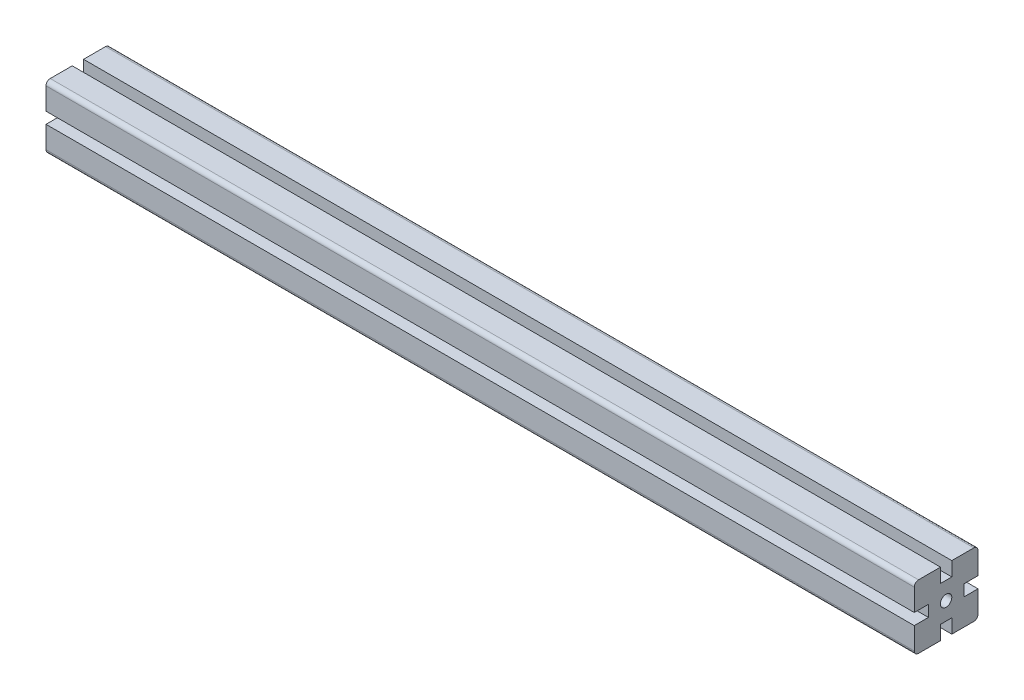
ISO-10303-21;
HEADER;
FILE_DESCRIPTION(('STEP AP214'),'2;1');
FILE_NAME('part.step','',(''),(''),'','','');
FILE_SCHEMA(('AUTOMOTIVE_DESIGN { 1 0 10303 214 1 1 1 1 }'));
ENDSEC;
DATA;
#1=APPLICATION_CONTEXT('core data for automotive mechanical design processes');
#2=APPLICATION_PROTOCOL_DEFINITION('international standard','automotive_design',2000,#1);
#3=PRODUCT_CONTEXT('',#1,'mechanical');
#4=PRODUCT('Part','Part','',(#3));
#5=PRODUCT_RELATED_PRODUCT_CATEGORY('part','',(#4));
#6=PRODUCT_DEFINITION_FORMATION('','',#4);
#7=PRODUCT_DEFINITION_CONTEXT('part definition',#1,'design');
#8=PRODUCT_DEFINITION('design','',#6,#7);
#9=PRODUCT_DEFINITION_SHAPE('','',#8);
#10=(LENGTH_UNIT() NAMED_UNIT(*) SI_UNIT(.MILLI.,.METRE.));
#11=(NAMED_UNIT(*) PLANE_ANGLE_UNIT() SI_UNIT($,.RADIAN.));
#12=(NAMED_UNIT(*) SI_UNIT($,.STERADIAN.) SOLID_ANGLE_UNIT());
#13=UNCERTAINTY_MEASURE_WITH_UNIT(LENGTH_MEASURE(1.E-05),#10,'distance_accuracy_value','');
#14=(GEOMETRIC_REPRESENTATION_CONTEXT(3) GLOBAL_UNCERTAINTY_ASSIGNED_CONTEXT((#13)) GLOBAL_UNIT_ASSIGNED_CONTEXT((#10,
#11,#12)) REPRESENTATION_CONTEXT('',''));
#15=CARTESIAN_POINT('',(0.,0.,0.));
#16=DIRECTION('',(0.,0.,1.));
#17=DIRECTION('',(1.,0.,0.));
#18=AXIS2_PLACEMENT_3D('',#15,#16,#17);
#19=CARTESIAN_POINT('',(387.,-22.5,-22.5));
#20=DIRECTION('',(0.,0.,-1.));
#21=DIRECTION('',(0.,1.,0.));
#22=AXIS2_PLACEMENT_3D('',#19,#20,#21);
#23=PLANE('',#22);
#24=DIRECTION('',(0.,1.,0.));
#25=VECTOR('',#24,1.);
#26=CARTESIAN_POINT('',(1000.,-22.5,-22.5));
#27=LINE('',#26,#25);
#28=CARTESIAN_POINT('',(1000.,-19.5,-22.5));
#29=VERTEX_POINT('',#28);
#30=CARTESIAN_POINT('',(1000.,-4.,-22.5));
#31=VERTEX_POINT('',#30);
#32=EDGE_CURVE('E268',#29,#31,#27,.T.);
#33=ORIENTED_EDGE('',*,*,#32,.F.);
#34=DIRECTION('',(1.,0.,0.));
#35=VECTOR('',#34,1.);
#36=CARTESIAN_POINT('',(387.,-19.5,-22.5));
#37=LINE('',#36,#35);
#38=CARTESIAN_POINT('',(387.,-19.5,-22.5));
#39=VERTEX_POINT('',#38);
#40=EDGE_CURVE('E199',#29,#39,#37,.F.);
#41=ORIENTED_EDGE('',*,*,#40,.T.);
#42=DIRECTION('',(0.,1.,0.));
#43=VECTOR('',#42,1.);
#44=CARTESIAN_POINT('',(387.,-22.5,-22.5));
#45=LINE('',#44,#43);
#46=CARTESIAN_POINT('',(387.,-4.,-22.5));
#47=VERTEX_POINT('',#46);
#48=EDGE_CURVE('E193',#39,#47,#45,.T.);
#49=ORIENTED_EDGE('',*,*,#48,.T.);
#50=DIRECTION('',(1.,0.,0.));
#51=VECTOR('',#50,1.);
#52=CARTESIAN_POINT('',(387.,-4.,-22.5));
#53=LINE('',#52,#51);
#54=EDGE_CURVE('E196',#47,#31,#53,.T.);
#55=ORIENTED_EDGE('',*,*,#54,.T.);
#56=EDGE_LOOP('',(#33,#41,#49,#55));
#57=FACE_BOUND('',#56,.T.);
#58=ADVANCED_FACE('F32',(#57),#23,.T.);
#59=CARTESIAN_POINT('',(387.,-22.5,-4.00000000000001));
#60=DIRECTION('',(0.,-1.,0.));
#61=DIRECTION('',(0.,0.,-1.));
#62=AXIS2_PLACEMENT_3D('',#59,#60,#61);
#63=PLANE('',#62);
#64=DIRECTION('',(0.,0.,-1.));
#65=VECTOR('',#64,1.);
#66=CARTESIAN_POINT('',(387.,-22.5,-4.00000000000001));
#67=LINE('',#66,#65);
#68=CARTESIAN_POINT('',(387.,-22.5,-4.00000000000001));
#69=VERTEX_POINT('',#68);
#70=CARTESIAN_POINT('',(387.,-22.5,-19.5));
#71=VERTEX_POINT('',#70);
#72=EDGE_CURVE('E211',#69,#71,#67,.T.);
#73=ORIENTED_EDGE('',*,*,#72,.T.);
#74=DIRECTION('',(1.,0.,0.));
#75=VECTOR('',#74,1.);
#76=CARTESIAN_POINT('',(387.,-22.5,-19.5));
#77=LINE('',#76,#75);
#78=CARTESIAN_POINT('',(1000.,-22.5,-19.5));
#79=VERTEX_POINT('',#78);
#80=EDGE_CURVE('E324',#71,#79,#77,.T.);
#81=ORIENTED_EDGE('',*,*,#80,.T.);
#82=DIRECTION('',(0.,0.,-1.));
#83=VECTOR('',#82,1.);
#84=CARTESIAN_POINT('',(1000.,-22.5,-4.00000000000001));
#85=LINE('',#84,#83);
#86=CARTESIAN_POINT('',(1000.,-22.5,-4.00000000000001));
#87=VERTEX_POINT('',#86);
#88=EDGE_CURVE('E203',#87,#79,#85,.T.);
#89=ORIENTED_EDGE('',*,*,#88,.F.);
#90=DIRECTION('',(1.,0.,0.));
#91=VECTOR('',#90,1.);
#92=CARTESIAN_POINT('',(387.,-22.5,-4.00000000000001));
#93=LINE('',#92,#91);
#94=EDGE_CURVE('E322',#69,#87,#93,.T.);
#95=ORIENTED_EDGE('',*,*,#94,.F.);
#96=EDGE_LOOP('',(#73,#81,#89,#95));
#97=FACE_BOUND('',#96,.T.);
#98=ADVANCED_FACE('F402',(#97),#63,.T.);
#99=CARTESIAN_POINT('',(387.,-12.5,-4.));
#100=DIRECTION('',(0.,0.,1.));
#101=DIRECTION('',(0.,-1.,0.));
#102=AXIS2_PLACEMENT_3D('',#99,#100,#101);
#103=PLANE('',#102);
#104=DIRECTION('',(0.,-1.,0.));
#105=VECTOR('',#104,1.);
#106=CARTESIAN_POINT('',(1000.,-12.5,-4.));
#107=LINE('',#106,#105);
#108=CARTESIAN_POINT('',(1000.,-12.5,-4.));
#109=VERTEX_POINT('',#108);
#110=EDGE_CURVE('E317',#109,#87,#107,.T.);
#111=ORIENTED_EDGE('',*,*,#110,.F.);
#112=DIRECTION('',(1.,0.,0.));
#113=VECTOR('',#112,1.);
#114=CARTESIAN_POINT('',(387.,-12.5,-4.));
#115=LINE('',#114,#113);
#116=CARTESIAN_POINT('',(387.,-12.5,-4.));
#117=VERTEX_POINT('',#116);
#118=EDGE_CURVE('E325',#117,#109,#115,.T.);
#119=ORIENTED_EDGE('',*,*,#118,.F.);
#120=DIRECTION('',(0.,-1.,0.));
#121=VECTOR('',#120,1.);
#122=CARTESIAN_POINT('',(387.,-12.5,-4.));
#123=LINE('',#122,#121);
#124=EDGE_CURVE('E263',#117,#69,#123,.T.);
#125=ORIENTED_EDGE('',*,*,#124,.T.);
#126=ORIENTED_EDGE('',*,*,#94,.T.);
#127=EDGE_LOOP('',(#111,#119,#125,#126));
#128=FACE_BOUND('',#127,.T.);
#129=ADVANCED_FACE('F406',(#128),#103,.T.);
#130=CARTESIAN_POINT('',(387.,-12.5,4.));
#131=DIRECTION('',(0.,-1.,0.));
#132=DIRECTION('',(0.,0.,-1.));
#133=AXIS2_PLACEMENT_3D('',#130,#131,#132);
#134=PLANE('',#133);
#135=DIRECTION('',(0.,0.,-1.));
#136=VECTOR('',#135,1.);
#137=CARTESIAN_POINT('',(1000.,-12.5,4.));
#138=LINE('',#137,#136);
#139=CARTESIAN_POINT('',(1000.,-12.5,4.));
#140=VERTEX_POINT('',#139);
#141=EDGE_CURVE('E314',#140,#109,#138,.T.);
#142=ORIENTED_EDGE('',*,*,#141,.F.);
#143=DIRECTION('',(1.,0.,0.));
#144=VECTOR('',#143,1.);
#145=CARTESIAN_POINT('',(387.,-12.5,4.));
#146=LINE('',#145,#144);
#147=CARTESIAN_POINT('',(387.,-12.5,4.));
#148=VERTEX_POINT('',#147);
#149=EDGE_CURVE('E327',#148,#140,#146,.T.);
#150=ORIENTED_EDGE('',*,*,#149,.F.);
#151=DIRECTION('',(0.,0.,-1.));
#152=VECTOR('',#151,1.);
#153=CARTESIAN_POINT('',(387.,-12.5,4.));
#154=LINE('',#153,#152);
#155=EDGE_CURVE('E260',#148,#117,#154,.T.);
#156=ORIENTED_EDGE('',*,*,#155,.T.);
#157=ORIENTED_EDGE('',*,*,#118,.T.);
#158=EDGE_LOOP('',(#142,#150,#156,#157));
#159=FACE_BOUND('',#158,.T.);
#160=ADVANCED_FACE('F411',(#159),#134,.T.);
#161=CARTESIAN_POINT('',(387.,-22.5,4.00000000000001));
#162=DIRECTION('',(0.,0.,-1.));
#163=DIRECTION('',(0.,1.,0.));
#164=AXIS2_PLACEMENT_3D('',#161,#162,#163);
#165=PLANE('',#164);
#166=DIRECTION('',(0.,1.,0.));
#167=VECTOR('',#166,1.);
#168=CARTESIAN_POINT('',(1000.,-22.5,4.00000000000001));
#169=LINE('',#168,#167);
#170=CARTESIAN_POINT('',(1000.,-22.5,4.00000000000001));
#171=VERTEX_POINT('',#170);
#172=EDGE_CURVE('E311',#171,#140,#169,.T.);
#173=ORIENTED_EDGE('',*,*,#172,.F.);
#174=DIRECTION('',(1.,0.,0.));
#175=VECTOR('',#174,1.);
#176=CARTESIAN_POINT('',(387.,-22.5,4.00000000000001));
#177=LINE('',#176,#175);
#178=CARTESIAN_POINT('',(387.,-22.5,4.00000000000001));
#179=VERTEX_POINT('',#178);
#180=EDGE_CURVE('E329',#179,#171,#177,.T.);
#181=ORIENTED_EDGE('',*,*,#180,.F.);
#182=DIRECTION('',(0.,1.,0.));
#183=VECTOR('',#182,1.);
#184=CARTESIAN_POINT('',(387.,-22.5,4.00000000000001));
#185=LINE('',#184,#183);
#186=EDGE_CURVE('E257',#179,#148,#185,.T.);
#187=ORIENTED_EDGE('',*,*,#186,.T.);
#188=ORIENTED_EDGE('',*,*,#149,.T.);
#189=EDGE_LOOP('',(#173,#181,#187,#188));
#190=FACE_BOUND('',#189,.T.);
#191=ADVANCED_FACE('F414',(#190),#165,.T.);
#192=CARTESIAN_POINT('',(387.,-22.5,22.5));
#193=DIRECTION('',(0.,-1.,0.));
#194=DIRECTION('',(0.,0.,-1.));
#195=AXIS2_PLACEMENT_3D('',#192,#193,#194);
#196=PLANE('',#195);
#197=DIRECTION('',(0.,0.,-1.));
#198=VECTOR('',#197,1.);
#199=CARTESIAN_POINT('',(1000.,-22.5,22.5));
#200=LINE('',#199,#198);
#201=CARTESIAN_POINT('',(1000.,-22.5,19.5));
#202=VERTEX_POINT('',#201);
#203=EDGE_CURVE('E309',#202,#171,#200,.T.);
#204=ORIENTED_EDGE('',*,*,#203,.F.);
#205=DIRECTION('',(1.,0.,0.));
#206=VECTOR('',#205,1.);
#207=CARTESIAN_POINT('',(387.,-22.5,19.5));
#208=LINE('',#207,#206);
#209=CARTESIAN_POINT('',(387.,-22.5,19.5));
#210=VERTEX_POINT('',#209);
#211=EDGE_CURVE('E376',#202,#210,#208,.F.);
#212=ORIENTED_EDGE('',*,*,#211,.T.);
#213=DIRECTION('',(0.,0.,-1.));
#214=VECTOR('',#213,1.);
#215=CARTESIAN_POINT('',(387.,-22.5,22.5));
#216=LINE('',#215,#214);
#217=EDGE_CURVE('E255',#210,#179,#216,.T.);
#218=ORIENTED_EDGE('',*,*,#217,.T.);
#219=ORIENTED_EDGE('',*,*,#180,.T.);
#220=EDGE_LOOP('',(#204,#212,#218,#219));
#221=FACE_BOUND('',#220,.T.);
#222=ADVANCED_FACE('F627',(#221),#196,.T.);
#223=CARTESIAN_POINT('',(387.,-4.,22.5));
#224=DIRECTION('',(0.,0.,1.));
#225=DIRECTION('',(0.,-1.,0.));
#226=AXIS2_PLACEMENT_3D('',#223,#224,#225);
#227=PLANE('',#226);
#228=DIRECTION('',(0.,-1.,0.));
#229=VECTOR('',#228,1.);
#230=CARTESIAN_POINT('',(387.,-4.,22.5));
#231=LINE('',#230,#229);
#232=CARTESIAN_POINT('',(387.,-4.,22.5));
#233=VERTEX_POINT('',#232);
#234=CARTESIAN_POINT('',(387.,-19.5,22.5));
#235=VERTEX_POINT('',#234);
#236=EDGE_CURVE('E252',#233,#235,#231,.T.);
#237=ORIENTED_EDGE('',*,*,#236,.T.);
#238=DIRECTION('',(1.,0.,0.));
#239=VECTOR('',#238,1.);
#240=CARTESIAN_POINT('',(387.,-19.5,22.5));
#241=LINE('',#240,#239);
#242=CARTESIAN_POINT('',(1000.,-19.5,22.5));
#243=VERTEX_POINT('',#242);
#244=EDGE_CURVE('E373',#235,#243,#241,.T.);
#245=ORIENTED_EDGE('',*,*,#244,.T.);
#246=DIRECTION('',(0.,-1.,0.));
#247=VECTOR('',#246,1.);
#248=CARTESIAN_POINT('',(1000.,-4.,22.5));
#249=LINE('',#248,#247);
#250=CARTESIAN_POINT('',(1000.,-4.,22.5));
#251=VERTEX_POINT('',#250);
#252=EDGE_CURVE('E306',#251,#243,#249,.T.);
#253=ORIENTED_EDGE('',*,*,#252,.F.);
#254=DIRECTION('',(1.,0.,0.));
#255=VECTOR('',#254,1.);
#256=CARTESIAN_POINT('',(387.,-4.,22.5));
#257=LINE('',#256,#255);
#258=EDGE_CURVE('E332',#233,#251,#257,.T.);
#259=ORIENTED_EDGE('',*,*,#258,.F.);
#260=EDGE_LOOP('',(#237,#245,#253,#259));
#261=FACE_BOUND('',#260,.T.);
#262=ADVANCED_FACE('F426',(#261),#227,.T.);
#263=CARTESIAN_POINT('',(387.,-4.,12.5));
#264=DIRECTION('',(0.,1.,0.));
#265=DIRECTION('',(0.,0.,1.));
#266=AXIS2_PLACEMENT_3D('',#263,#264,#265);
#267=PLANE('',#266);
#268=DIRECTION('',(0.,0.,1.));
#269=VECTOR('',#268,1.);
#270=CARTESIAN_POINT('',(1000.,-4.,12.5));
#271=LINE('',#270,#269);
#272=CARTESIAN_POINT('',(1000.,-4.,12.5));
#273=VERTEX_POINT('',#272);
#274=EDGE_CURVE('E303',#273,#251,#271,.T.);
#275=ORIENTED_EDGE('',*,*,#274,.F.);
#276=DIRECTION('',(1.,0.,0.));
#277=VECTOR('',#276,1.);
#278=CARTESIAN_POINT('',(387.,-4.,12.5));
#279=LINE('',#278,#277);
#280=CARTESIAN_POINT('',(387.,-4.,12.5));
#281=VERTEX_POINT('',#280);
#282=EDGE_CURVE('E334',#281,#273,#279,.T.);
#283=ORIENTED_EDGE('',*,*,#282,.F.);
#284=DIRECTION('',(0.,0.,1.));
#285=VECTOR('',#284,1.);
#286=CARTESIAN_POINT('',(387.,-4.,12.5));
#287=LINE('',#286,#285);
#288=EDGE_CURVE('E249',#281,#233,#287,.T.);
#289=ORIENTED_EDGE('',*,*,#288,.T.);
#290=ORIENTED_EDGE('',*,*,#258,.T.);
#291=EDGE_LOOP('',(#275,#283,#289,#290));
#292=FACE_BOUND('',#291,.T.);
#293=ADVANCED_FACE('F431',(#292),#267,.T.);
#294=CARTESIAN_POINT('',(387.,4.,12.5));
#295=DIRECTION('',(0.,0.,1.));
#296=DIRECTION('',(1.,0.,0.));
#297=AXIS2_PLACEMENT_3D('',#294,#295,#296);
#298=PLANE('',#297);
#299=DIRECTION('',(0.,-1.,0.));
#300=VECTOR('',#299,1.);
#301=CARTESIAN_POINT('',(1000.,4.,12.5));
#302=LINE('',#301,#300);
#303=CARTESIAN_POINT('',(1000.,4.,12.5));
#304=VERTEX_POINT('',#303);
#305=EDGE_CURVE('E300',#304,#273,#302,.T.);
#306=ORIENTED_EDGE('',*,*,#305,.F.);
#307=DIRECTION('',(1.,0.,0.));
#308=VECTOR('',#307,1.);
#309=CARTESIAN_POINT('',(387.,4.,12.5));
#310=LINE('',#309,#308);
#311=CARTESIAN_POINT('',(387.,4.,12.5));
#312=VERTEX_POINT('',#311);
#313=EDGE_CURVE('E336',#312,#304,#310,.T.);
#314=ORIENTED_EDGE('',*,*,#313,.F.);
#315=DIRECTION('',(0.,-1.,0.));
#316=VECTOR('',#315,1.);
#317=CARTESIAN_POINT('',(387.,4.,12.5));
#318=LINE('',#317,#316);
#319=EDGE_CURVE('E246',#312,#281,#318,.T.);
#320=ORIENTED_EDGE('',*,*,#319,.T.);
#321=ORIENTED_EDGE('',*,*,#282,.T.);
#322=EDGE_LOOP('',(#306,#314,#320,#321));
#323=FACE_BOUND('',#322,.T.);
#324=ADVANCED_FACE('F436',(#323),#298,.T.);
#325=CARTESIAN_POINT('',(387.,4.,22.5));
#326=DIRECTION('',(0.,-1.,0.));
#327=DIRECTION('',(0.,0.,-1.));
#328=AXIS2_PLACEMENT_3D('',#325,#326,#327);
#329=PLANE('',#328);
#330=DIRECTION('',(0.,0.,-1.));
#331=VECTOR('',#330,1.);
#332=CARTESIAN_POINT('',(1000.,4.,22.5));
#333=LINE('',#332,#331);
#334=CARTESIAN_POINT('',(1000.,4.,22.5));
#335=VERTEX_POINT('',#334);
#336=EDGE_CURVE('E297',#335,#304,#333,.T.);
#337=ORIENTED_EDGE('',*,*,#336,.F.);
#338=DIRECTION('',(1.,0.,0.));
#339=VECTOR('',#338,1.);
#340=CARTESIAN_POINT('',(387.,4.,22.5));
#341=LINE('',#340,#339);
#342=CARTESIAN_POINT('',(387.,4.,22.5));
#343=VERTEX_POINT('',#342);
#344=EDGE_CURVE('E338',#343,#335,#341,.T.);
#345=ORIENTED_EDGE('',*,*,#344,.F.);
#346=DIRECTION('',(0.,0.,-1.));
#347=VECTOR('',#346,1.);
#348=CARTESIAN_POINT('',(387.,4.,22.5));
#349=LINE('',#348,#347);
#350=EDGE_CURVE('E243',#343,#312,#349,.T.);
#351=ORIENTED_EDGE('',*,*,#350,.T.);
#352=ORIENTED_EDGE('',*,*,#313,.T.);
#353=EDGE_LOOP('',(#337,#345,#351,#352));
#354=FACE_BOUND('',#353,.T.);
#355=ADVANCED_FACE('F439',(#354),#329,.T.);
#356=CARTESIAN_POINT('',(387.,22.5,22.5));
#357=DIRECTION('',(0.,0.,1.));
#358=DIRECTION('',(0.,-1.,0.));
#359=AXIS2_PLACEMENT_3D('',#356,#357,#358);
#360=PLANE('',#359);
#361=DIRECTION('',(0.,-1.,0.));
#362=VECTOR('',#361,1.);
#363=CARTESIAN_POINT('',(1000.,22.5,22.5));
#364=LINE('',#363,#362);
#365=CARTESIAN_POINT('',(1000.,19.5,22.5));
#366=VERTEX_POINT('',#365);
#367=EDGE_CURVE('E295',#366,#335,#364,.T.);
#368=ORIENTED_EDGE('',*,*,#367,.F.);
#369=DIRECTION('',(1.,0.,0.));
#370=VECTOR('',#369,1.);
#371=CARTESIAN_POINT('',(387.,19.5,22.5));
#372=LINE('',#371,#370);
#373=CARTESIAN_POINT('',(387.,19.5,22.5));
#374=VERTEX_POINT('',#373);
#375=EDGE_CURVE('E381',#366,#374,#372,.F.);
#376=ORIENTED_EDGE('',*,*,#375,.T.);
#377=DIRECTION('',(0.,-1.,0.));
#378=VECTOR('',#377,1.);
#379=CARTESIAN_POINT('',(387.,22.5,22.5));
#380=LINE('',#379,#378);
#381=EDGE_CURVE('E241',#374,#343,#380,.T.);
#382=ORIENTED_EDGE('',*,*,#381,.T.);
#383=ORIENTED_EDGE('',*,*,#344,.T.);
#384=EDGE_LOOP('',(#368,#376,#382,#383));
#385=FACE_BOUND('',#384,.T.);
#386=ADVANCED_FACE('F591',(#385),#360,.T.);
#387=CARTESIAN_POINT('',(387.,22.5,4.));
#388=DIRECTION('',(0.,1.,0.));
#389=DIRECTION('',(0.,0.,1.));
#390=AXIS2_PLACEMENT_3D('',#387,#388,#389);
#391=PLANE('',#390);
#392=DIRECTION('',(0.,0.,1.));
#393=VECTOR('',#392,1.);
#394=CARTESIAN_POINT('',(387.,22.5,4.));
#395=LINE('',#394,#393);
#396=CARTESIAN_POINT('',(387.,22.5,4.));
#397=VERTEX_POINT('',#396);
#398=CARTESIAN_POINT('',(387.,22.5,19.5));
#399=VERTEX_POINT('',#398);
#400=EDGE_CURVE('E238',#397,#399,#395,.T.);
#401=ORIENTED_EDGE('',*,*,#400,.T.);
#402=DIRECTION('',(1.,0.,0.));
#403=VECTOR('',#402,1.);
#404=CARTESIAN_POINT('',(387.,22.5,19.5));
#405=LINE('',#404,#403);
#406=CARTESIAN_POINT('',(1000.,22.5,19.5));
#407=VERTEX_POINT('',#406);
#408=EDGE_CURVE('E378',#399,#407,#405,.T.);
#409=ORIENTED_EDGE('',*,*,#408,.T.);
#410=DIRECTION('',(0.,0.,1.));
#411=VECTOR('',#410,1.);
#412=CARTESIAN_POINT('',(1000.,22.5,4.));
#413=LINE('',#412,#411);
#414=CARTESIAN_POINT('',(1000.,22.5,4.));
#415=VERTEX_POINT('',#414);
#416=EDGE_CURVE('E292',#415,#407,#413,.T.);
#417=ORIENTED_EDGE('',*,*,#416,.F.);
#418=DIRECTION('',(1.,0.,0.));
#419=VECTOR('',#418,1.);
#420=CARTESIAN_POINT('',(387.,22.5,4.));
#421=LINE('',#420,#419);
#422=EDGE_CURVE('E341',#397,#415,#421,.T.);
#423=ORIENTED_EDGE('',*,*,#422,.F.);
#424=EDGE_LOOP('',(#401,#409,#417,#423));
#425=FACE_BOUND('',#424,.T.);
#426=ADVANCED_FACE('F451',(#425),#391,.T.);
#427=CARTESIAN_POINT('',(387.,12.5,4.));
#428=DIRECTION('',(0.,0.,-1.));
#429=DIRECTION('',(0.,1.,0.));
#430=AXIS2_PLACEMENT_3D('',#427,#428,#429);
#431=PLANE('',#430);
#432=DIRECTION('',(0.,1.,0.));
#433=VECTOR('',#432,1.);
#434=CARTESIAN_POINT('',(1000.,12.5,4.));
#435=LINE('',#434,#433);
#436=CARTESIAN_POINT('',(1000.,12.5,4.));
#437=VERTEX_POINT('',#436);
#438=EDGE_CURVE('E289',#437,#415,#435,.T.);
#439=ORIENTED_EDGE('',*,*,#438,.F.);
#440=DIRECTION('',(1.,0.,0.));
#441=VECTOR('',#440,1.);
#442=CARTESIAN_POINT('',(387.,12.5,4.));
#443=LINE('',#442,#441);
#444=CARTESIAN_POINT('',(387.,12.5,4.));
#445=VERTEX_POINT('',#444);
#446=EDGE_CURVE('E343',#445,#437,#443,.T.);
#447=ORIENTED_EDGE('',*,*,#446,.F.);
#448=DIRECTION('',(0.,1.,0.));
#449=VECTOR('',#448,1.);
#450=CARTESIAN_POINT('',(387.,12.5,4.));
#451=LINE('',#450,#449);
#452=EDGE_CURVE('E235',#445,#397,#451,.T.);
#453=ORIENTED_EDGE('',*,*,#452,.T.);
#454=ORIENTED_EDGE('',*,*,#422,.T.);
#455=EDGE_LOOP('',(#439,#447,#453,#454));
#456=FACE_BOUND('',#455,.T.);
#457=ADVANCED_FACE('F456',(#456),#431,.T.);
#458=CARTESIAN_POINT('',(387.,12.5,-4.));
#459=DIRECTION('',(0.,1.,0.));
#460=DIRECTION('',(0.,0.,1.));
#461=AXIS2_PLACEMENT_3D('',#458,#459,#460);
#462=PLANE('',#461);
#463=DIRECTION('',(0.,0.,1.));
#464=VECTOR('',#463,1.);
#465=CARTESIAN_POINT('',(1000.,12.5,-4.));
#466=LINE('',#465,#464);
#467=CARTESIAN_POINT('',(1000.,12.5,-4.));
#468=VERTEX_POINT('',#467);
#469=EDGE_CURVE('E286',#468,#437,#466,.T.);
#470=ORIENTED_EDGE('',*,*,#469,.F.);
#471=DIRECTION('',(1.,0.,0.));
#472=VECTOR('',#471,1.);
#473=CARTESIAN_POINT('',(387.,12.5,-4.));
#474=LINE('',#473,#472);
#475=CARTESIAN_POINT('',(387.,12.5,-4.));
#476=VERTEX_POINT('',#475);
#477=EDGE_CURVE('E345',#476,#468,#474,.T.);
#478=ORIENTED_EDGE('',*,*,#477,.F.);
#479=DIRECTION('',(0.,0.,1.));
#480=VECTOR('',#479,1.);
#481=CARTESIAN_POINT('',(387.,12.5,-4.));
#482=LINE('',#481,#480);
#483=EDGE_CURVE('E232',#476,#445,#482,.T.);
#484=ORIENTED_EDGE('',*,*,#483,.T.);
#485=ORIENTED_EDGE('',*,*,#446,.T.);
#486=EDGE_LOOP('',(#470,#478,#484,#485));
#487=FACE_BOUND('',#486,.T.);
#488=ADVANCED_FACE('F461',(#487),#462,.T.);
#489=CARTESIAN_POINT('',(387.,22.5,-4.));
#490=DIRECTION('',(0.,0.,1.));
#491=DIRECTION('',(0.,-1.,0.));
#492=AXIS2_PLACEMENT_3D('',#489,#490,#491);
#493=PLANE('',#492);
#494=DIRECTION('',(0.,-1.,0.));
#495=VECTOR('',#494,1.);
#496=CARTESIAN_POINT('',(1000.,22.5,-4.));
#497=LINE('',#496,#495);
#498=CARTESIAN_POINT('',(1000.,22.5,-4.));
#499=VERTEX_POINT('',#498);
#500=EDGE_CURVE('E283',#499,#468,#497,.T.);
#501=ORIENTED_EDGE('',*,*,#500,.F.);
#502=DIRECTION('',(1.,0.,0.));
#503=VECTOR('',#502,1.);
#504=CARTESIAN_POINT('',(387.,22.5,-4.));
#505=LINE('',#504,#503);
#506=CARTESIAN_POINT('',(387.,22.5,-4.));
#507=VERTEX_POINT('',#506);
#508=EDGE_CURVE('E347',#507,#499,#505,.T.);
#509=ORIENTED_EDGE('',*,*,#508,.F.);
#510=DIRECTION('',(0.,-1.,0.));
#511=VECTOR('',#510,1.);
#512=CARTESIAN_POINT('',(387.,22.5,-4.));
#513=LINE('',#512,#511);
#514=EDGE_CURVE('E229',#507,#476,#513,.T.);
#515=ORIENTED_EDGE('',*,*,#514,.T.);
#516=ORIENTED_EDGE('',*,*,#477,.T.);
#517=EDGE_LOOP('',(#501,#509,#515,#516));
#518=FACE_BOUND('',#517,.T.);
#519=ADVANCED_FACE('F464',(#518),#493,.T.);
#520=CARTESIAN_POINT('',(387.,22.5,-22.5));
#521=DIRECTION('',(0.,1.,0.));
#522=DIRECTION('',(0.,0.,1.));
#523=AXIS2_PLACEMENT_3D('',#520,#521,#522);
#524=PLANE('',#523);
#525=DIRECTION('',(0.,0.,1.));
#526=VECTOR('',#525,1.);
#527=CARTESIAN_POINT('',(1000.,22.5,-22.5));
#528=LINE('',#527,#526);
#529=CARTESIAN_POINT('',(1000.,22.5,-19.5));
#530=VERTEX_POINT('',#529);
#531=EDGE_CURVE('E281',#530,#499,#528,.T.);
#532=ORIENTED_EDGE('',*,*,#531,.F.);
#533=DIRECTION('',(1.,0.,0.));
#534=VECTOR('',#533,1.);
#535=CARTESIAN_POINT('',(387.,22.5,-19.5));
#536=LINE('',#535,#534);
#537=CARTESIAN_POINT('',(387.,22.5,-19.5));
#538=VERTEX_POINT('',#537);
#539=EDGE_CURVE('E11',#530,#538,#536,.F.);
#540=ORIENTED_EDGE('',*,*,#539,.T.);
#541=DIRECTION('',(0.,0.,1.));
#542=VECTOR('',#541,1.);
#543=CARTESIAN_POINT('',(387.,22.5,-22.5));
#544=LINE('',#543,#542);
#545=EDGE_CURVE('E227',#538,#507,#544,.T.);
#546=ORIENTED_EDGE('',*,*,#545,.T.);
#547=ORIENTED_EDGE('',*,*,#508,.T.);
#548=EDGE_LOOP('',(#532,#540,#546,#547));
#549=FACE_BOUND('',#548,.T.);
#550=ADVANCED_FACE('F555',(#549),#524,.T.);
#551=CARTESIAN_POINT('',(387.,4.,-22.5));
#552=DIRECTION('',(0.,0.,-1.));
#553=DIRECTION('',(0.,1.,0.));
#554=AXIS2_PLACEMENT_3D('',#551,#552,#553);
#555=PLANE('',#554);
#556=DIRECTION('',(0.,1.,0.));
#557=VECTOR('',#556,1.);
#558=CARTESIAN_POINT('',(387.,4.,-22.5));
#559=LINE('',#558,#557);
#560=CARTESIAN_POINT('',(387.,4.,-22.5));
#561=VERTEX_POINT('',#560);
#562=CARTESIAN_POINT('',(387.,19.5,-22.5));
#563=VERTEX_POINT('',#562);
#564=EDGE_CURVE('E225',#561,#563,#559,.T.);
#565=ORIENTED_EDGE('',*,*,#564,.T.);
#566=DIRECTION('',(1.,0.,0.));
#567=VECTOR('',#566,1.);
#568=CARTESIAN_POINT('',(387.,19.5,-22.5));
#569=LINE('',#568,#567);
#570=CARTESIAN_POINT('',(1000.,19.5,-22.5));
#571=VERTEX_POINT('',#570);
#572=EDGE_CURVE('E40',#563,#571,#569,.T.);
#573=ORIENTED_EDGE('',*,*,#572,.T.);
#574=DIRECTION('',(0.,1.,0.));
#575=VECTOR('',#574,1.);
#576=CARTESIAN_POINT('',(1000.,4.,-22.5));
#577=LINE('',#576,#575);
#578=CARTESIAN_POINT('',(1000.,4.,-22.5));
#579=VERTEX_POINT('',#578);
#580=EDGE_CURVE('E278',#579,#571,#577,.T.);
#581=ORIENTED_EDGE('',*,*,#580,.F.);
#582=DIRECTION('',(1.,0.,0.));
#583=VECTOR('',#582,1.);
#584=CARTESIAN_POINT('',(387.,4.,-22.5));
#585=LINE('',#584,#583);
#586=EDGE_CURVE('E350',#561,#579,#585,.T.);
#587=ORIENTED_EDGE('',*,*,#586,.F.);
#588=EDGE_LOOP('',(#565,#573,#581,#587));
#589=FACE_BOUND('',#588,.T.);
#590=ADVANCED_FACE('F386',(#589),#555,.T.);
#591=CARTESIAN_POINT('',(387.,4.,-12.5));
#592=DIRECTION('',(0.,-1.,0.));
#593=DIRECTION('',(0.,0.,-1.));
#594=AXIS2_PLACEMENT_3D('',#591,#592,#593);
#595=PLANE('',#594);
#596=DIRECTION('',(0.,0.,-1.));
#597=VECTOR('',#596,1.);
#598=CARTESIAN_POINT('',(1000.,4.,-12.5));
#599=LINE('',#598,#597);
#600=CARTESIAN_POINT('',(1000.,4.,-12.5));
#601=VERTEX_POINT('',#600);
#602=EDGE_CURVE('E275',#601,#579,#599,.T.);
#603=ORIENTED_EDGE('',*,*,#602,.F.);
#604=DIRECTION('',(1.,0.,0.));
#605=VECTOR('',#604,1.);
#606=CARTESIAN_POINT('',(387.,4.,-12.5));
#607=LINE('',#606,#605);
#608=CARTESIAN_POINT('',(387.,4.,-12.5));
#609=VERTEX_POINT('',#608);
#610=EDGE_CURVE('E352',#609,#601,#607,.T.);
#611=ORIENTED_EDGE('',*,*,#610,.F.);
#612=DIRECTION('',(0.,0.,-1.));
#613=VECTOR('',#612,1.);
#614=CARTESIAN_POINT('',(387.,4.,-12.5));
#615=LINE('',#614,#613);
#616=EDGE_CURVE('E219',#609,#561,#615,.T.);
#617=ORIENTED_EDGE('',*,*,#616,.T.);
#618=ORIENTED_EDGE('',*,*,#586,.T.);
#619=EDGE_LOOP('',(#603,#611,#617,#618));
#620=FACE_BOUND('',#619,.T.);
#621=ADVANCED_FACE('F393',(#620),#595,.T.);
#622=CARTESIAN_POINT('',(387.,-4.,-12.5));
#623=DIRECTION('',(0.,0.,-1.));
#624=DIRECTION('',(-1.,0.,0.));
#625=AXIS2_PLACEMENT_3D('',#622,#623,#624);
#626=PLANE('',#625);
#627=DIRECTION('',(0.,1.,0.));
#628=VECTOR('',#627,1.);
#629=CARTESIAN_POINT('',(1000.,-4.,-12.5));
#630=LINE('',#629,#628);
#631=CARTESIAN_POINT('',(1000.,-4.,-12.5));
#632=VERTEX_POINT('',#631);
#633=EDGE_CURVE('E272',#632,#601,#630,.T.);
#634=ORIENTED_EDGE('',*,*,#633,.F.);
#635=DIRECTION('',(1.,0.,0.));
#636=VECTOR('',#635,1.);
#637=CARTESIAN_POINT('',(387.,-4.,-12.5));
#638=LINE('',#637,#636);
#639=CARTESIAN_POINT('',(387.,-4.,-12.5));
#640=VERTEX_POINT('',#639);
#641=EDGE_CURVE('E210',#640,#632,#638,.T.);
#642=ORIENTED_EDGE('',*,*,#641,.F.);
#643=DIRECTION('',(0.,1.,0.));
#644=VECTOR('',#643,1.);
#645=CARTESIAN_POINT('',(387.,-4.,-12.5));
#646=LINE('',#645,#644);
#647=EDGE_CURVE('E217',#640,#609,#646,.T.);
#648=ORIENTED_EDGE('',*,*,#647,.T.);
#649=ORIENTED_EDGE('',*,*,#610,.T.);
#650=EDGE_LOOP('',(#634,#642,#648,#649));
#651=FACE_BOUND('',#650,.T.);
#652=ADVANCED_FACE('F395',(#651),#626,.T.);
#653=CARTESIAN_POINT('',(387.,-4.,-22.5));
#654=DIRECTION('',(0.,1.,0.));
#655=DIRECTION('',(0.,0.,1.));
#656=AXIS2_PLACEMENT_3D('',#653,#654,#655);
#657=PLANE('',#656);
#658=DIRECTION('',(0.,0.,1.));
#659=VECTOR('',#658,1.);
#660=CARTESIAN_POINT('',(1000.,-4.,-22.5));
#661=LINE('',#660,#659);
#662=EDGE_CURVE('E209',#31,#632,#661,.T.);
#663=ORIENTED_EDGE('',*,*,#662,.F.);
#664=ORIENTED_EDGE('',*,*,#54,.F.);
#665=DIRECTION('',(0.,0.,1.));
#666=VECTOR('',#665,1.);
#667=CARTESIAN_POINT('',(387.,-4.,-22.5));
#668=LINE('',#667,#666);
#669=EDGE_CURVE('E202',#47,#640,#668,.T.);
#670=ORIENTED_EDGE('',*,*,#669,.T.);
#671=ORIENTED_EDGE('',*,*,#641,.T.);
#672=EDGE_LOOP('',(#663,#664,#670,#671));
#673=FACE_BOUND('',#672,.T.);
#674=ADVANCED_FACE('F207',(#673),#657,.T.);
#675=CARTESIAN_POINT('',(387.,0.,0.));
#676=DIRECTION('',(1.,0.,0.));
#677=DIRECTION('',(0.,0.,-1.));
#678=AXIS2_PLACEMENT_3D('',#675,#676,#677);
#679=PLANE('',#678);
#680=CARTESIAN_POINT('',(387.,0.,0.));
#681=DIRECTION('',(1.,0.,0.));
#682=DIRECTION('',(0.,0.,1.));
#683=AXIS2_PLACEMENT_3D('',#680,#681,#682);
#684=CIRCLE('',#683,4.);
#685=CARTESIAN_POINT('',(387.,0.,4.));
#686=VERTEX_POINT('',#685);
#687=EDGE_CURVE('E270',#686,#686,#684,.T.);
#688=ORIENTED_EDGE('',*,*,#687,.T.);
#689=EDGE_LOOP('',(#688));
#690=FACE_BOUND('',#689,.T.);
#691=ORIENTED_EDGE('',*,*,#48,.F.);
#692=CARTESIAN_POINT('',(387.,-19.5,-19.5));
#693=DIRECTION('',(1.,0.,0.));
#694=DIRECTION('',(0.,0.,-1.));
#695=AXIS2_PLACEMENT_3D('',#692,#693,#694);
#696=CIRCLE('',#695,3.);
#697=EDGE_CURVE('E371',#39,#71,#696,.F.);
#698=ORIENTED_EDGE('',*,*,#697,.T.);
#699=ORIENTED_EDGE('',*,*,#72,.F.);
#700=ORIENTED_EDGE('',*,*,#124,.F.);
#701=ORIENTED_EDGE('',*,*,#155,.F.);
#702=ORIENTED_EDGE('',*,*,#186,.F.);
#703=ORIENTED_EDGE('',*,*,#217,.F.);
#704=CARTESIAN_POINT('',(387.,-19.5,19.5));
#705=DIRECTION('',(1.,0.,0.));
#706=DIRECTION('',(0.,0.,-1.));
#707=AXIS2_PLACEMENT_3D('',#704,#705,#706);
#708=CIRCLE('',#707,3.);
#709=EDGE_CURVE('E369',#210,#235,#708,.F.);
#710=ORIENTED_EDGE('',*,*,#709,.T.);
#711=ORIENTED_EDGE('',*,*,#236,.F.);
#712=ORIENTED_EDGE('',*,*,#288,.F.);
#713=ORIENTED_EDGE('',*,*,#319,.F.);
#714=ORIENTED_EDGE('',*,*,#350,.F.);
#715=ORIENTED_EDGE('',*,*,#381,.F.);
#716=CARTESIAN_POINT('',(387.,19.5,19.5));
#717=DIRECTION('',(1.,0.,0.));
#718=DIRECTION('',(0.,0.,-1.));
#719=AXIS2_PLACEMENT_3D('',#716,#717,#718);
#720=CIRCLE('',#719,3.);
#721=EDGE_CURVE('E367',#374,#399,#720,.F.);
#722=ORIENTED_EDGE('',*,*,#721,.T.);
#723=ORIENTED_EDGE('',*,*,#400,.F.);
#724=ORIENTED_EDGE('',*,*,#452,.F.);
#725=ORIENTED_EDGE('',*,*,#483,.F.);
#726=ORIENTED_EDGE('',*,*,#514,.F.);
#727=ORIENTED_EDGE('',*,*,#545,.F.);
#728=CARTESIAN_POINT('',(387.,19.5,-19.5));
#729=DIRECTION('',(1.,0.,0.));
#730=DIRECTION('',(0.,0.,-1.));
#731=AXIS2_PLACEMENT_3D('',#728,#729,#730);
#732=CIRCLE('',#731,3.);
#733=EDGE_CURVE('E47',#538,#563,#732,.F.);
#734=ORIENTED_EDGE('',*,*,#733,.T.);
#735=ORIENTED_EDGE('',*,*,#564,.F.);
#736=ORIENTED_EDGE('',*,*,#616,.F.);
#737=ORIENTED_EDGE('',*,*,#647,.F.);
#738=ORIENTED_EDGE('',*,*,#669,.F.);
#739=EDGE_LOOP('',(#691,#698,#699,#700,#701,#702,#703,#710,#711,#712,#713,#714,#715,#722,#723,
#724,#725,#726,#727,#734,#735,#736,#737,#738));
#740=FACE_BOUND('',#739,.T.);
#741=ADVANCED_FACE('F214',(#690,#740),#679,.F.);
#742=CARTESIAN_POINT('',(1000.,0.,0.));
#743=DIRECTION('',(1.,0.,0.));
#744=DIRECTION('',(0.,0.,-1.));
#745=AXIS2_PLACEMENT_3D('',#742,#743,#744);
#746=PLANE('',#745);
#747=CARTESIAN_POINT('',(1000.,0.,0.));
#748=DIRECTION('',(1.,0.,0.));
#749=DIRECTION('',(0.,0.,1.));
#750=AXIS2_PLACEMENT_3D('',#747,#748,#749);
#751=CIRCLE('',#750,4.);
#752=CARTESIAN_POINT('',(1000.,0.,4.));
#753=VERTEX_POINT('',#752);
#754=EDGE_CURVE('E689',#753,#753,#751,.T.);
#755=ORIENTED_EDGE('',*,*,#754,.F.);
#756=EDGE_LOOP('',(#755));
#757=FACE_BOUND('',#756,.T.);
#758=ORIENTED_EDGE('',*,*,#88,.T.);
#759=CARTESIAN_POINT('',(1000.,-19.5,-19.5));
#760=DIRECTION('',(1.,0.,0.));
#761=DIRECTION('',(0.,0.,-1.));
#762=AXIS2_PLACEMENT_3D('',#759,#760,#761);
#763=CIRCLE('',#762,3.);
#764=EDGE_CURVE('E363',#79,#29,#763,.T.);
#765=ORIENTED_EDGE('',*,*,#764,.T.);
#766=ORIENTED_EDGE('',*,*,#32,.T.);
#767=ORIENTED_EDGE('',*,*,#662,.T.);
#768=ORIENTED_EDGE('',*,*,#633,.T.);
#769=ORIENTED_EDGE('',*,*,#602,.T.);
#770=ORIENTED_EDGE('',*,*,#580,.T.);
#771=CARTESIAN_POINT('',(1000.,19.5,-19.5));
#772=DIRECTION('',(1.,0.,0.));
#773=DIRECTION('',(0.,0.,-1.));
#774=AXIS2_PLACEMENT_3D('',#771,#772,#773);
#775=CIRCLE('',#774,3.);
#776=EDGE_CURVE('E357',#571,#530,#775,.T.);
#777=ORIENTED_EDGE('',*,*,#776,.T.);
#778=ORIENTED_EDGE('',*,*,#531,.T.);
#779=ORIENTED_EDGE('',*,*,#500,.T.);
#780=ORIENTED_EDGE('',*,*,#469,.T.);
#781=ORIENTED_EDGE('',*,*,#438,.T.);
#782=ORIENTED_EDGE('',*,*,#416,.T.);
#783=CARTESIAN_POINT('',(1000.,19.5,19.5));
#784=DIRECTION('',(1.,0.,0.));
#785=DIRECTION('',(0.,0.,-1.));
#786=AXIS2_PLACEMENT_3D('',#783,#784,#785);
#787=CIRCLE('',#786,3.);
#788=EDGE_CURVE('E359',#407,#366,#787,.T.);
#789=ORIENTED_EDGE('',*,*,#788,.T.);
#790=ORIENTED_EDGE('',*,*,#367,.T.);
#791=ORIENTED_EDGE('',*,*,#336,.T.);
#792=ORIENTED_EDGE('',*,*,#305,.T.);
#793=ORIENTED_EDGE('',*,*,#274,.T.);
#794=ORIENTED_EDGE('',*,*,#252,.T.);
#795=CARTESIAN_POINT('',(1000.,-19.5,19.5));
#796=DIRECTION('',(1.,0.,0.));
#797=DIRECTION('',(0.,0.,-1.));
#798=AXIS2_PLACEMENT_3D('',#795,#796,#797);
#799=CIRCLE('',#798,3.);
#800=EDGE_CURVE('E361',#243,#202,#799,.T.);
#801=ORIENTED_EDGE('',*,*,#800,.T.);
#802=ORIENTED_EDGE('',*,*,#203,.T.);
#803=ORIENTED_EDGE('',*,*,#172,.T.);
#804=ORIENTED_EDGE('',*,*,#141,.T.);
#805=ORIENTED_EDGE('',*,*,#110,.T.);
#806=EDGE_LOOP('',(#758,#765,#766,#767,#768,#769,#770,#777,#778,#779,#780,#781,#782,#789,#790,
#791,#792,#793,#794,#801,#802,#803,#804,#805));
#807=FACE_BOUND('',#806,.T.);
#808=ADVANCED_FACE('F389',(#757,#807),#746,.T.);
#809=CARTESIAN_POINT('',(387.,0.,0.));
#810=DIRECTION('',(1.,0.,0.));
#811=DIRECTION('',(0.,0.,-1.));
#812=AXIS2_PLACEMENT_3D('',#809,#810,#811);
#813=CYLINDRICAL_SURFACE('',#812,4.);
#814=ORIENTED_EDGE('',*,*,#687,.F.);
#815=EDGE_LOOP('',(#814));
#816=FACE_BOUND('',#815,.T.);
#817=ORIENTED_EDGE('',*,*,#754,.T.);
#818=EDGE_LOOP('',(#817));
#819=FACE_BOUND('',#818,.T.);
#820=ADVANCED_FACE('F481',(#816,#819),#813,.F.);
#821=CARTESIAN_POINT('',(387.,-19.5,-19.5));
#822=DIRECTION('',(1.,0.,0.));
#823=DIRECTION('',(0.,0.,-1.));
#824=AXIS2_PLACEMENT_3D('',#821,#822,#823);
#825=CYLINDRICAL_SURFACE('',#824,3.);
#826=ORIENTED_EDGE('',*,*,#697,.F.);
#827=ORIENTED_EDGE('',*,*,#40,.F.);
#828=ORIENTED_EDGE('',*,*,#764,.F.);
#829=ORIENTED_EDGE('',*,*,#80,.F.);
#830=EDGE_LOOP('',(#826,#827,#828,#829));
#831=FACE_BOUND('',#830,.T.);
#832=ADVANCED_FACE('F397',(#831),#825,.T.);
#833=CARTESIAN_POINT('',(387.,-19.5,19.5));
#834=DIRECTION('',(1.,0.,0.));
#835=DIRECTION('',(0.,0.,-1.));
#836=AXIS2_PLACEMENT_3D('',#833,#834,#835);
#837=CYLINDRICAL_SURFACE('',#836,3.);
#838=ORIENTED_EDGE('',*,*,#709,.F.);
#839=ORIENTED_EDGE('',*,*,#211,.F.);
#840=ORIENTED_EDGE('',*,*,#800,.F.);
#841=ORIENTED_EDGE('',*,*,#244,.F.);
#842=EDGE_LOOP('',(#838,#839,#840,#841));
#843=FACE_BOUND('',#842,.T.);
#844=ADVANCED_FACE('F423',(#843),#837,.T.);
#845=CARTESIAN_POINT('',(387.,19.5,19.5));
#846=DIRECTION('',(1.,0.,0.));
#847=DIRECTION('',(0.,0.,-1.));
#848=AXIS2_PLACEMENT_3D('',#845,#846,#847);
#849=CYLINDRICAL_SURFACE('',#848,3.);
#850=ORIENTED_EDGE('',*,*,#721,.F.);
#851=ORIENTED_EDGE('',*,*,#375,.F.);
#852=ORIENTED_EDGE('',*,*,#788,.F.);
#853=ORIENTED_EDGE('',*,*,#408,.F.);
#854=EDGE_LOOP('',(#850,#851,#852,#853));
#855=FACE_BOUND('',#854,.T.);
#856=ADVANCED_FACE('F448',(#855),#849,.T.);
#857=CARTESIAN_POINT('',(387.,19.5,-19.5));
#858=DIRECTION('',(1.,0.,0.));
#859=DIRECTION('',(0.,0.,-1.));
#860=AXIS2_PLACEMENT_3D('',#857,#858,#859);
#861=CYLINDRICAL_SURFACE('',#860,3.);
#862=ORIENTED_EDGE('',*,*,#733,.F.);
#863=ORIENTED_EDGE('',*,*,#539,.F.);
#864=ORIENTED_EDGE('',*,*,#776,.F.);
#865=ORIENTED_EDGE('',*,*,#572,.F.);
#866=EDGE_LOOP('',(#862,#863,#864,#865));
#867=FACE_BOUND('',#866,.T.);
#868=ADVANCED_FACE('F34',(#867),#861,.T.);
#869=CLOSED_SHELL('',(#58,#98,#129,#160,#191,#222,#262,#293,#324,#355,#386,#426,#457,#488,#519,
#550,#590,#621,#652,#674,#741,#808,#820,#832,#844,#856,#868));
#870=MANIFOLD_SOLID_BREP('B2',#869);
#871=ADVANCED_BREP_SHAPE_REPRESENTATION('',(#18,#870),#14);
#872=SHAPE_DEFINITION_REPRESENTATION(#9,#871);
ENDSEC;
END-ISO-10303-21;
